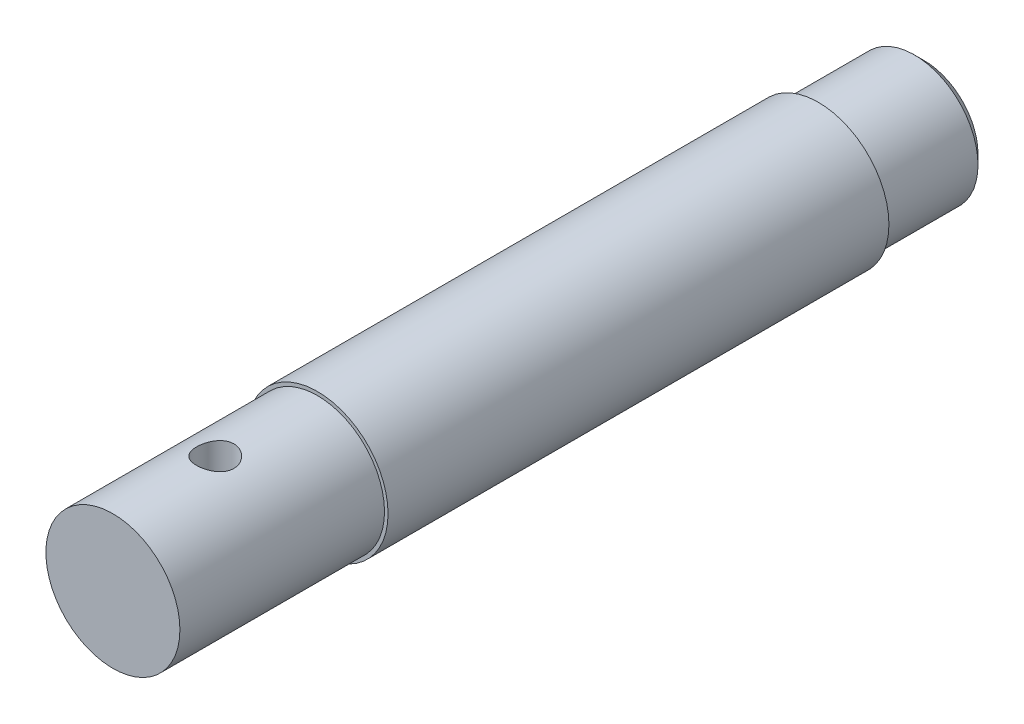
ISO-10303-21;
HEADER;
FILE_DESCRIPTION(('STEP AP214'),'2;1');
FILE_NAME('part.step','',(''),(''),'','','');
FILE_SCHEMA(('AUTOMOTIVE_DESIGN { 1 0 10303 214 1 1 1 1 }'));
ENDSEC;
DATA;
#1=APPLICATION_CONTEXT('core data for automotive mechanical design processes');
#2=APPLICATION_PROTOCOL_DEFINITION('international standard','automotive_design',2000,#1);
#3=PRODUCT_CONTEXT('',#1,'mechanical');
#4=PRODUCT('Part','Part','',(#3));
#5=PRODUCT_RELATED_PRODUCT_CATEGORY('part','',(#4));
#6=PRODUCT_DEFINITION_FORMATION('','',#4);
#7=PRODUCT_DEFINITION_CONTEXT('part definition',#1,'design');
#8=PRODUCT_DEFINITION('design','',#6,#7);
#9=PRODUCT_DEFINITION_SHAPE('','',#8);
#10=(LENGTH_UNIT() NAMED_UNIT(*) SI_UNIT(.MILLI.,.METRE.));
#11=(NAMED_UNIT(*) PLANE_ANGLE_UNIT() SI_UNIT($,.RADIAN.));
#12=(NAMED_UNIT(*) SI_UNIT($,.STERADIAN.) SOLID_ANGLE_UNIT());
#13=UNCERTAINTY_MEASURE_WITH_UNIT(LENGTH_MEASURE(1.E-05),#10,'distance_accuracy_value','');
#14=(GEOMETRIC_REPRESENTATION_CONTEXT(3) GLOBAL_UNCERTAINTY_ASSIGNED_CONTEXT((#13)) GLOBAL_UNIT_ASSIGNED_CONTEXT((#10,
#11,#12)) REPRESENTATION_CONTEXT('',''));
#15=CARTESIAN_POINT('',(0.,0.,0.));
#16=DIRECTION('',(0.,0.,1.));
#17=DIRECTION('',(1.,0.,0.));
#18=AXIS2_PLACEMENT_3D('',#15,#16,#17);
#19=CARTESIAN_POINT('',(0.,0.,57.5));
#20=DIRECTION('',(0.,0.,-1.));
#21=DIRECTION('',(-1.,0.,0.));
#22=AXIS2_PLACEMENT_3D('',#19,#20,#21);
#23=CYLINDRICAL_SURFACE('',#22,10.);
#24=CARTESIAN_POINT('',(0.,0.,-42.5));
#25=DIRECTION('',(0.,0.,1.));
#26=DIRECTION('',(1.,0.,0.));
#27=AXIS2_PLACEMENT_3D('',#24,#25,#26);
#28=CIRCLE('',#27,9.99999999999999);
#29=CARTESIAN_POINT('',(9.99999999999999,0.,-42.5));
#30=VERTEX_POINT('',#29);
#31=EDGE_CURVE('E51',#30,#30,#28,.T.);
#32=ORIENTED_EDGE('',*,*,#31,.T.);
#33=EDGE_LOOP('',(#32));
#34=FACE_BOUND('',#33,.T.);
#35=CARTESIAN_POINT('',(0.,0.,28.5));
#36=DIRECTION('',(0.,0.,1.));
#37=DIRECTION('',(1.,0.,0.));
#38=AXIS2_PLACEMENT_3D('',#35,#36,#37);
#39=CIRCLE('',#38,9.99999999999999);
#40=CARTESIAN_POINT('',(9.99999999999999,0.,28.5));
#41=VERTEX_POINT('',#40);
#42=EDGE_CURVE('E97',#41,#41,#39,.T.);
#43=ORIENTED_EDGE('',*,*,#42,.F.);
#44=EDGE_LOOP('',(#43));
#45=FACE_BOUND('',#44,.T.);
#46=ADVANCED_FACE('F38',(#34,#45),#23,.T.);
#47=CARTESIAN_POINT('',(0.,0.,-57.5));
#48=DIRECTION('',(0.,0.,1.));
#49=DIRECTION('',(1.,0.,0.));
#50=AXIS2_PLACEMENT_3D('',#47,#48,#49);
#51=CYLINDRICAL_SURFACE('',#50,9.);
#52=CARTESIAN_POINT('',(0.,0.,-42.5));
#53=DIRECTION('',(0.,0.,1.));
#54=DIRECTION('',(1.,0.,0.));
#55=AXIS2_PLACEMENT_3D('',#52,#53,#54);
#56=CIRCLE('',#55,9.);
#57=CARTESIAN_POINT('',(9.,0.,-42.5));
#58=VERTEX_POINT('',#57);
#59=EDGE_CURVE('E10',#58,#58,#56,.T.);
#60=ORIENTED_EDGE('',*,*,#59,.F.);
#61=EDGE_LOOP('',(#60));
#62=FACE_BOUND('',#61,.T.);
#63=CARTESIAN_POINT('',(0.,0.,-56.126));
#64=DIRECTION('',(0.,0.,1.));
#65=DIRECTION('',(1.,0.,0.));
#66=AXIS2_PLACEMENT_3D('',#63,#64,#65);
#67=CIRCLE('',#66,9.);
#68=CARTESIAN_POINT('',(9.,0.,-56.126));
#69=VERTEX_POINT('',#68);
#70=EDGE_CURVE('E100',#69,#69,#67,.T.);
#71=ORIENTED_EDGE('',*,*,#70,.T.);
#72=EDGE_LOOP('',(#71));
#73=FACE_BOUND('',#72,.T.);
#74=ADVANCED_FACE('F85',(#62,#73),#51,.T.);
#75=CARTESIAN_POINT('',(9.,0.,-42.5));
#76=DIRECTION('',(0.,0.,1.));
#77=DIRECTION('',(1.,0.,0.));
#78=AXIS2_PLACEMENT_3D('',#75,#76,#77);
#79=PLANE('',#78);
#80=ORIENTED_EDGE('',*,*,#31,.F.);
#81=EDGE_LOOP('',(#80));
#82=FACE_BOUND('',#81,.T.);
#83=ORIENTED_EDGE('',*,*,#59,.T.);
#84=EDGE_LOOP('',(#83));
#85=FACE_BOUND('',#84,.T.);
#86=ADVANCED_FACE('F90',(#82,#85),#79,.F.);
#87=CARTESIAN_POINT('',(0.,0.,-57.5));
#88=DIRECTION('',(0.,0.,1.));
#89=DIRECTION('',(1.,0.,0.));
#90=AXIS2_PLACEMENT_3D('',#87,#88,#89);
#91=CONICAL_SURFACE('',#90,7.626,0.785398163397455);
#92=ORIENTED_EDGE('',*,*,#70,.F.);
#93=EDGE_LOOP('',(#92));
#94=FACE_BOUND('',#93,.T.);
#95=CARTESIAN_POINT('',(0.,0.,-57.5));
#96=DIRECTION('',(0.,0.,1.));
#97=DIRECTION('',(1.,0.,0.));
#98=AXIS2_PLACEMENT_3D('',#95,#96,#97);
#99=CIRCLE('',#98,7.626);
#100=CARTESIAN_POINT('',(7.626,0.,-57.5));
#101=VERTEX_POINT('',#100);
#102=EDGE_CURVE('E58',#101,#101,#99,.T.);
#103=ORIENTED_EDGE('',*,*,#102,.T.);
#104=EDGE_LOOP('',(#103));
#105=FACE_BOUND('',#104,.T.);
#106=ADVANCED_FACE('F116',(#94,#105),#91,.T.);
#107=CARTESIAN_POINT('',(0.,0.,-57.5));
#108=DIRECTION('',(0.,0.,1.));
#109=DIRECTION('',(1.,0.,0.));
#110=AXIS2_PLACEMENT_3D('',#107,#108,#109);
#111=PLANE('',#110);
#112=ORIENTED_EDGE('',*,*,#102,.F.);
#113=EDGE_LOOP('',(#112));
#114=FACE_BOUND('',#113,.T.);
#115=ADVANCED_FACE('F118',(#114),#111,.F.);
#116=CARTESIAN_POINT('',(0.,0.,28.5));
#117=DIRECTION('',(0.,0.,1.));
#118=DIRECTION('',(1.,0.,0.));
#119=AXIS2_PLACEMENT_3D('',#116,#117,#118);
#120=PLANE('',#119);
#121=CARTESIAN_POINT('',(0.,0.,28.5));
#122=DIRECTION('',(0.,0.,1.));
#123=DIRECTION('',(1.,0.,0.));
#124=AXIS2_PLACEMENT_3D('',#121,#122,#123);
#125=CIRCLE('',#124,9.5);
#126=CARTESIAN_POINT('',(9.5,0.,28.5));
#127=VERTEX_POINT('',#126);
#128=EDGE_CURVE('E101',#127,#127,#125,.T.);
#129=ORIENTED_EDGE('',*,*,#128,.F.);
#130=EDGE_LOOP('',(#129));
#131=FACE_BOUND('',#130,.T.);
#132=ORIENTED_EDGE('',*,*,#42,.T.);
#133=EDGE_LOOP('',(#132));
#134=FACE_BOUND('',#133,.T.);
#135=ADVANCED_FACE('F120',(#131,#134),#120,.T.);
#136=CARTESIAN_POINT('',(0.,0.,28.5));
#137=DIRECTION('',(0.,0.,1.));
#138=DIRECTION('',(1.,0.,0.));
#139=AXIS2_PLACEMENT_3D('',#136,#137,#138);
#140=CYLINDRICAL_SURFACE('',#139,9.5);
#141=CARTESIAN_POINT('',(0.,-9.5,45.65));
#142=CARTESIAN_POINT('',(-0.145834099659645,-9.49999808003396,45.6499970892488));
#143=CARTESIAN_POINT('',(-0.291698532801508,-9.49660924277311,45.6379215236776));
#144=CARTESIAN_POINT('',(-0.579209025378516,-9.48342026335043,45.590034103422));
#145=CARTESIAN_POINT('',(-0.720853306420264,-9.47361745717199,45.554212385786));
#146=CARTESIAN_POINT('',(-0.995733085594919,-9.44867973836868,45.4601002482184));
#147=CARTESIAN_POINT('',(-1.12897970626465,-9.43355206119978,45.4018403073694));
#148=CARTESIAN_POINT('',(-1.38381191790006,-9.39955384990711,45.2646228345878));
#149=CARTESIAN_POINT('',(-1.50539644494426,-9.3806829747759,45.1856634167103));
#150=CARTESIAN_POINT('',(-1.7365134647349,-9.34069592065438,45.0071913133959));
#151=CARTESIAN_POINT('',(-1.84571067986586,-9.319538572778,44.907253678426));
#152=CARTESIAN_POINT('',(-2.04603303477211,-9.27762064224113,44.6905693940427));
#153=CARTESIAN_POINT('',(-2.13715560823632,-9.25686011630064,44.5738203617344));
#154=CARTESIAN_POINT('',(-2.30042238948461,-9.21766030723124,44.324094257744));
#155=CARTESIAN_POINT('',(-2.37217256452616,-9.19927269829441,44.1908507115809));
#156=CARTESIAN_POINT('',(-2.49211664237424,-9.16750956038129,43.9135947062189));
#157=CARTESIAN_POINT('',(-2.54031534757674,-9.15413300972667,43.7695844493785));
#158=CARTESIAN_POINT('',(-2.61060797764441,-9.13433300205164,43.4786153692976));
#159=CARTESIAN_POINT('',(-2.63331353099395,-9.12774696022365,43.3318156466656));
#160=CARTESIAN_POINT('',(-2.65388335464117,-9.12178862533113,43.0363542820331));
#161=CARTESIAN_POINT('',(-2.65175274497967,-9.12241484543939,42.8876930301041));
#162=CARTESIAN_POINT('',(-2.62319444098087,-9.13066526365298,42.5975717854547));
#163=CARTESIAN_POINT('',(-2.59751590079997,-9.13807368060119,42.4560309228507));
#164=CARTESIAN_POINT('',(-2.52379425702126,-9.15870697367352,42.179351083596));
#165=CARTESIAN_POINT('',(-2.47574921646428,-9.17193235354642,42.0442126625195));
#166=CARTESIAN_POINT('',(-2.35806914290097,-9.20289281896455,41.7822641177744));
#167=CARTESIAN_POINT('',(-2.28817854584757,-9.22068081442196,41.6555753247165));
#168=CARTESIAN_POINT('',(-2.1289693064579,-9.25873489194035,41.4154649871327));
#169=CARTESIAN_POINT('',(-2.0396465184901,-9.27900150238039,41.3020462815776));
#170=CARTESIAN_POINT('',(-1.84031693964528,-9.32061932177232,41.0874260822207));
#171=CARTESIAN_POINT('',(-1.72968358651565,-9.34198337059303,40.9868081163292));
#172=CARTESIAN_POINT('',(-1.49285002816034,-9.38274031502671,40.8054279760459));
#173=CARTESIAN_POINT('',(-1.36664908993165,-9.40213311774469,40.7246667371484));
#174=CARTESIAN_POINT('',(-1.10130357447117,-9.43690108966364,40.5850017011411));
#175=CARTESIAN_POINT('',(-0.962096026667359,-9.45225517752446,40.5262119456913));
#176=CARTESIAN_POINT('',(-0.675245266974982,-9.47706370900547,40.4330427230765));
#177=CARTESIAN_POINT('',(-0.527604087500579,-9.48651956754251,40.3986574012976));
#178=CARTESIAN_POINT('',(-0.233050069384361,-9.49824872488775,40.3562088956373));
#179=CARTESIAN_POINT('',(-0.0862598608986299,-9.50073818033956,40.3473532921997));
#180=CARTESIAN_POINT('',(0.206711327506863,-9.49888001176469,40.3540156161572));
#181=CARTESIAN_POINT('',(0.352892374920166,-9.49453316652918,40.3695307672364));
#182=CARTESIAN_POINT('',(0.637609596926216,-9.47963117752454,40.4238471697617));
#183=CARTESIAN_POINT('',(0.77623837832273,-9.46919594523129,40.4621989436126));
#184=CARTESIAN_POINT('',(1.04507541794759,-9.44330827981003,40.5605712990768));
#185=CARTESIAN_POINT('',(1.17528272091443,-9.42785527870138,40.6205943338301));
#186=CARTESIAN_POINT('',(1.42660198118864,-9.3931490393351,40.7620249160585));
#187=CARTESIAN_POINT('',(1.54746661217034,-9.37382304855229,40.8438536455361));
#188=CARTESIAN_POINT('',(1.77402443244138,-9.33360053816328,41.0260498369027));
#189=CARTESIAN_POINT('',(1.87971432541363,-9.3127036788242,41.1264213159265));
#190=CARTESIAN_POINT('',(2.07631661424361,-9.27088665698881,41.3465630552236));
#191=CARTESIAN_POINT('',(2.16666790597566,-9.24998593956095,41.466839105593));
#192=CARTESIAN_POINT('',(2.32592650639015,-9.21123274860881,41.721293997429));
#193=CARTESIAN_POINT('',(2.39483462545746,-9.19338015990053,41.8554723132429));
#194=CARTESIAN_POINT('',(2.50873963667734,-9.16295278837751,42.1333190354824));
#195=CARTESIAN_POINT('',(2.55386845627225,-9.15034896899329,42.2769300014178));
#196=CARTESIAN_POINT('',(2.61920650466114,-9.13186357313916,42.5701192379367));
#197=CARTESIAN_POINT('',(2.63942284707314,-9.12598007775354,42.7196957924799));
#198=CARTESIAN_POINT('',(2.6539253006978,-9.12177227455125,43.0147968405735));
#199=CARTESIAN_POINT('',(2.64911755509749,-9.12318379474538,43.160273670962));
#200=CARTESIAN_POINT('',(2.61583198459762,-9.13278252711367,43.4482543436127));
#201=CARTESIAN_POINT('',(2.5873548816262,-9.14096953263185,43.590758276414));
#202=CARTESIAN_POINT('',(2.50808651198729,-9.16303214838051,43.8674867810268));
#203=CARTESIAN_POINT('',(2.45750430350275,-9.17685438339215,44.0017757971861));
#204=CARTESIAN_POINT('',(2.33562324145773,-9.20862707206947,44.2600660055611));
#205=CARTESIAN_POINT('',(2.26432086743481,-9.2265782271517,44.3840654449184));
#206=CARTESIAN_POINT('',(2.10034943767856,-9.26530266394752,44.6225395865211));
#207=CARTESIAN_POINT('',(2.00707026212505,-9.28614781193327,44.7365831453507));
#208=CARTESIAN_POINT('',(1.80293119622319,-9.32792989495429,44.9476927522994));
#209=CARTESIAN_POINT('',(1.69206694369541,-9.34886685150737,45.0447545753078));
#210=CARTESIAN_POINT('',(1.45268575453287,-9.38907694788089,45.2214548451116));
#211=CARTESIAN_POINT('',(1.32380808582086,-9.40829789586412,45.3006175642999));
#212=CARTESIAN_POINT('',(1.05403847382746,-9.44232134633192,45.436031648748));
#213=CARTESIAN_POINT('',(0.913153574489075,-9.45712641672552,45.4922963365735));
#214=CARTESIAN_POINT('',(0.644188994233583,-9.47895312134662,45.5737819027664));
#215=CARTESIAN_POINT('',(0.517162867654348,-9.48678552103202,45.6022935240701));
#216=CARTESIAN_POINT('',(0.260098960384677,-9.49730950750576,45.6404027337491));
#217=CARTESIAN_POINT('',(0.130061543653003,-9.50000171231384,45.6500025959415));
#218=CARTESIAN_POINT('',(0.,-9.5,45.65));
#219=B_SPLINE_CURVE_WITH_KNOTS('',3,(#141,#142,#143,#144,#145,#146,#147,#148,#149,#150,#151,
#152,#153,#154,#155,#156,#157,#158,#159,#160,#161,#162,#163,#164,#165,#166,#167,#168,#169,#170,
#171,#172,#173,#174,#175,#176,#177,#178,#179,#180,#181,#182,#183,#184,#185,#186,#187,#188,#189,
#190,#191,#192,#193,#194,#195,#196,#197,#198,#199,#200,#201,#202,#203,#204,#205,#206,#207,#208,
#209,#210,#211,#212,#213,#214,#215,#216,#217,#218),.UNSPECIFIED.,.T.,.F.,(4,2,2,2,2,2,2,2,2,2,2,
2,2,2,2,2,2,2,2,2,2,2,2,2,2,2,2,2,2,2,2,2,2,2,2,2,2,2,4),(0.,0.437025057290832,
0.874231746534771,1.31084663642181,1.74750132045254,2.19404432923995,2.64065069470652,
3.09575349682394,3.5507634598577,3.99460665432256,4.43835835095524,4.86846460702025,
5.29860811760715,5.7339849946957,6.16945484561194,6.62053142401494,7.07162924956577,
7.52503698334628,7.97833590799368,8.41740486750904,8.85642381192402,9.28707490591834,
9.71777476397868,10.1574868453409,10.5972942986718,11.0507653351607,11.5042192318954,
11.955130150966,12.4059122850976,12.8404873460808,13.2750491527768,13.7055871609701,
14.1361983625923,14.5805737397579,15.025059522207,15.4802463450493,15.9351679505046,
16.3249738258041,16.714732830721),.UNSPECIFIED.);
#220=CARTESIAN_POINT('',(0.,-9.5,45.65));
#221=VERTEX_POINT('',#220);
#222=EDGE_CURVE('E41',#221,#221,#219,.T.);
#223=ORIENTED_EDGE('',*,*,#222,.F.);
#224=EDGE_LOOP('',(#223));
#225=FACE_BOUND('',#224,.T.);
#226=CARTESIAN_POINT('',(0.,9.5,40.35));
#227=CARTESIAN_POINT('',(-0.145834099659645,9.49999808003396,40.3500029107512));
#228=CARTESIAN_POINT('',(-0.291698532801508,9.49660924277311,40.3620784763224));
#229=CARTESIAN_POINT('',(-0.579209025378516,9.48342026335043,40.409965896578));
#230=CARTESIAN_POINT('',(-0.720853306420264,9.47361745717199,40.445787614214));
#231=CARTESIAN_POINT('',(-0.995733085594919,9.44867973836868,40.5398997517816));
#232=CARTESIAN_POINT('',(-1.12897970626465,9.43355206119978,40.5981596926306));
#233=CARTESIAN_POINT('',(-1.38381191790006,9.39955384990711,40.7353771654122));
#234=CARTESIAN_POINT('',(-1.50539644494426,9.3806829747759,40.8143365832897));
#235=CARTESIAN_POINT('',(-1.7365134647349,9.34069592065438,40.9928086866042));
#236=CARTESIAN_POINT('',(-1.84571067986586,9.319538572778,41.092746321574));
#237=CARTESIAN_POINT('',(-2.04603303477211,9.27762064224113,41.3094306059573));
#238=CARTESIAN_POINT('',(-2.13715560823632,9.25686011630064,41.4261796382656));
#239=CARTESIAN_POINT('',(-2.30042238948461,9.21766030723124,41.675905742256));
#240=CARTESIAN_POINT('',(-2.37217256452616,9.19927269829441,41.8091492884191));
#241=CARTESIAN_POINT('',(-2.49211664237424,9.16750956038129,42.0864052937811));
#242=CARTESIAN_POINT('',(-2.54031534757674,9.15413300972667,42.2304155506215));
#243=CARTESIAN_POINT('',(-2.61060797764441,9.13433300205164,42.5213846307024));
#244=CARTESIAN_POINT('',(-2.63331353099395,9.12774696022365,42.6681843533344));
#245=CARTESIAN_POINT('',(-2.65388335464117,9.12178862533113,42.9636457179669));
#246=CARTESIAN_POINT('',(-2.65175274497967,9.12241484543939,43.1123069698959));
#247=CARTESIAN_POINT('',(-2.62319444098087,9.13066526365298,43.4024282145453));
#248=CARTESIAN_POINT('',(-2.59751590079997,9.13807368060119,43.5439690771493));
#249=CARTESIAN_POINT('',(-2.52379425702126,9.15870697367352,43.820648916404));
#250=CARTESIAN_POINT('',(-2.47574921646428,9.17193235354642,43.9557873374805));
#251=CARTESIAN_POINT('',(-2.35806914290097,9.20289281896455,44.2177358822256));
#252=CARTESIAN_POINT('',(-2.28817854584757,9.22068081442196,44.3444246752835));
#253=CARTESIAN_POINT('',(-2.1289693064579,9.25873489194035,44.5845350128673));
#254=CARTESIAN_POINT('',(-2.0396465184901,9.27900150238039,44.6979537184224));
#255=CARTESIAN_POINT('',(-1.84031693964528,9.32061932177232,44.9125739177793));
#256=CARTESIAN_POINT('',(-1.72968358651565,9.34198337059302,45.0131918836708));
#257=CARTESIAN_POINT('',(-1.49285002816034,9.38274031502671,45.1945720239541));
#258=CARTESIAN_POINT('',(-1.36664908993165,9.40213311774469,45.2753332628516));
#259=CARTESIAN_POINT('',(-1.10130357447118,9.43690108966364,45.4149982988589));
#260=CARTESIAN_POINT('',(-0.962096026667359,9.45225517752446,45.4737880543087));
#261=CARTESIAN_POINT('',(-0.675245266974982,9.47706370900547,45.5669572769235));
#262=CARTESIAN_POINT('',(-0.52760408750058,9.48651956754251,45.6013425987024));
#263=CARTESIAN_POINT('',(-0.233050069384361,9.49824872488775,45.6437911043628));
#264=CARTESIAN_POINT('',(-0.08625986089863,9.50073818033956,45.6526467078003));
#265=CARTESIAN_POINT('',(0.206711327506863,9.49888001176469,45.6459843838428));
#266=CARTESIAN_POINT('',(0.352892374920166,9.49453316652918,45.6304692327636));
#267=CARTESIAN_POINT('',(0.637609596926217,9.47963117752454,45.5761528302383));
#268=CARTESIAN_POINT('',(0.776238378322732,9.46919594523129,45.5378010563874));
#269=CARTESIAN_POINT('',(1.04507541794759,9.44330827981003,45.4394287009232));
#270=CARTESIAN_POINT('',(1.17528272091443,9.42785527870138,45.37940566617));
#271=CARTESIAN_POINT('',(1.42660198118864,9.3931490393351,45.2379750839415));
#272=CARTESIAN_POINT('',(1.54746661217034,9.37382304855229,45.1561463544639));
#273=CARTESIAN_POINT('',(1.77402443244138,9.33360053816328,44.9739501630973));
#274=CARTESIAN_POINT('',(1.87971432541363,9.3127036788242,44.8735786840735));
#275=CARTESIAN_POINT('',(2.07631661424361,9.27088665698881,44.6534369447764));
#276=CARTESIAN_POINT('',(2.16666790597566,9.24998593956095,44.533160894407));
#277=CARTESIAN_POINT('',(2.32592650639015,9.21123274860881,44.278706002571));
#278=CARTESIAN_POINT('',(2.39483462545746,9.19338015990053,44.1445276867571));
#279=CARTESIAN_POINT('',(2.50873963667734,9.16295278837751,43.8666809645176));
#280=CARTESIAN_POINT('',(2.55386845627225,9.15034896899329,43.7230699985822));
#281=CARTESIAN_POINT('',(2.61920650466115,9.13186357313916,43.4298807620633));
#282=CARTESIAN_POINT('',(2.63942284707314,9.12598007775354,43.2803042075201));
#283=CARTESIAN_POINT('',(2.6539253006978,9.12177227455125,42.9852031594265));
#284=CARTESIAN_POINT('',(2.64911755509749,9.12318379474538,42.839726329038));
#285=CARTESIAN_POINT('',(2.61583198459762,9.13278252711367,42.5517456563873));
#286=CARTESIAN_POINT('',(2.5873548816262,9.14096953263185,42.409241723586));
#287=CARTESIAN_POINT('',(2.50808651198729,9.16303214838051,42.1325132189732));
#288=CARTESIAN_POINT('',(2.45750430350275,9.17685438339215,41.9982242028139));
#289=CARTESIAN_POINT('',(2.33562324145773,9.20862707206947,41.7399339944389));
#290=CARTESIAN_POINT('',(2.26432086743481,9.2265782271517,41.6159345550816));
#291=CARTESIAN_POINT('',(2.10034943767856,9.26530266394752,41.3774604134789));
#292=CARTESIAN_POINT('',(2.00707026212505,9.28614781193328,41.2634168546493));
#293=CARTESIAN_POINT('',(1.80293119622318,9.32792989495429,41.0523072477006));
#294=CARTESIAN_POINT('',(1.6920669436954,9.34886685150737,40.9552454246922));
#295=CARTESIAN_POINT('',(1.45268575453286,9.38907694788089,40.7785451548884));
#296=CARTESIAN_POINT('',(1.32380808582086,9.40829789586412,40.6993824357001));
#297=CARTESIAN_POINT('',(1.05403847382745,9.44232134633193,40.563968351252));
#298=CARTESIAN_POINT('',(0.913153574489072,9.45712641672552,40.5077036634266));
#299=CARTESIAN_POINT('',(0.644188994233582,9.47895312134662,40.4262180972336));
#300=CARTESIAN_POINT('',(0.517162867654346,9.48678552103202,40.3977064759299));
#301=CARTESIAN_POINT('',(0.260098960384676,9.49730950750576,40.3595972662509));
#302=CARTESIAN_POINT('',(0.130061543653002,9.50000171231384,40.3499974040585));
#303=CARTESIAN_POINT('',(0.,9.5,40.35));
#304=B_SPLINE_CURVE_WITH_KNOTS('',3,(#226,#227,#228,#229,#230,#231,#232,#233,#234,#235,#236,
#237,#238,#239,#240,#241,#242,#243,#244,#245,#246,#247,#248,#249,#250,#251,#252,#253,#254,#255,
#256,#257,#258,#259,#260,#261,#262,#263,#264,#265,#266,#267,#268,#269,#270,#271,#272,#273,#274,
#275,#276,#277,#278,#279,#280,#281,#282,#283,#284,#285,#286,#287,#288,#289,#290,#291,#292,#293,
#294,#295,#296,#297,#298,#299,#300,#301,#302,#303),.UNSPECIFIED.,.T.,.F.,(4,2,2,2,2,2,2,2,2,2,2,
2,2,2,2,2,2,2,2,2,2,2,2,2,2,2,2,2,2,2,2,2,2,2,2,2,2,2,4),(0.,0.437025057290832,
0.874231746534771,1.31084663642181,1.74750132045254,2.19404432923995,2.64065069470652,
3.09575349682394,3.5507634598577,3.99460665432256,4.43835835095524,4.86846460702024,
5.29860811760715,5.7339849946957,6.16945484561193,6.62053142401493,7.07162924956577,
7.52503698334628,7.97833590799368,8.41740486750904,8.85642381192402,9.28707490591834,
9.71777476397868,10.1574868453409,10.5972942986718,11.0507653351607,11.5042192318954,
11.955130150966,12.4059122850976,12.8404873460808,13.2750491527768,13.7055871609701,
14.1361983625923,14.5805737397579,15.025059522207,15.4802463450493,15.9351679505046,
16.3249738258041,16.714732830721),.UNSPECIFIED.);
#305=CARTESIAN_POINT('',(0.,9.5,40.35));
#306=VERTEX_POINT('',#305);
#307=EDGE_CURVE('E61',#306,#306,#304,.T.);
#308=ORIENTED_EDGE('',*,*,#307,.F.);
#309=EDGE_LOOP('',(#308));
#310=FACE_BOUND('',#309,.T.);
#311=ORIENTED_EDGE('',*,*,#128,.T.);
#312=EDGE_LOOP('',(#311));
#313=FACE_BOUND('',#312,.T.);
#314=CARTESIAN_POINT('',(0.,0.,57.5));
#315=DIRECTION('',(0.,0.,1.));
#316=DIRECTION('',(1.,0.,0.));
#317=AXIS2_PLACEMENT_3D('',#314,#315,#316);
#318=CIRCLE('',#317,9.5);
#319=CARTESIAN_POINT('',(9.5,0.,57.5));
#320=VERTEX_POINT('',#319);
#321=EDGE_CURVE('E68',#320,#320,#318,.T.);
#322=ORIENTED_EDGE('',*,*,#321,.F.);
#323=EDGE_LOOP('',(#322));
#324=FACE_BOUND('',#323,.T.);
#325=ADVANCED_FACE('F69',(#225,#310,#313,#324),#140,.T.);
#326=CARTESIAN_POINT('',(0.,0.,57.5));
#327=DIRECTION('',(0.,0.,1.));
#328=DIRECTION('',(1.,0.,0.));
#329=AXIS2_PLACEMENT_3D('',#326,#327,#328);
#330=PLANE('',#329);
#331=ORIENTED_EDGE('',*,*,#321,.T.);
#332=EDGE_LOOP('',(#331));
#333=FACE_BOUND('',#332,.T.);
#334=ADVANCED_FACE('F75',(#333),#330,.T.);
#335=CARTESIAN_POINT('',(0.,0.,43.));
#336=DIRECTION('',(0.,-1.,0.));
#337=DIRECTION('',(0.,0.,-1.));
#338=AXIS2_PLACEMENT_3D('',#335,#336,#337);
#339=CYLINDRICAL_SURFACE('',#338,2.65);
#340=ORIENTED_EDGE('',*,*,#307,.T.);
#341=EDGE_LOOP('',(#340));
#342=FACE_BOUND('',#341,.T.);
#343=ORIENTED_EDGE('',*,*,#222,.T.);
#344=EDGE_LOOP('',(#343));
#345=FACE_BOUND('',#344,.T.);
#346=ADVANCED_FACE('F72',(#342,#345),#339,.F.);
#347=CLOSED_SHELL('',(#46,#74,#86,#106,#115,#135,#325,#334,#346));
#348=MANIFOLD_SOLID_BREP('B2',#347);
#349=ADVANCED_BREP_SHAPE_REPRESENTATION('',(#18,#348),#14);
#350=SHAPE_DEFINITION_REPRESENTATION(#9,#349);
ENDSEC;
END-ISO-10303-21;
